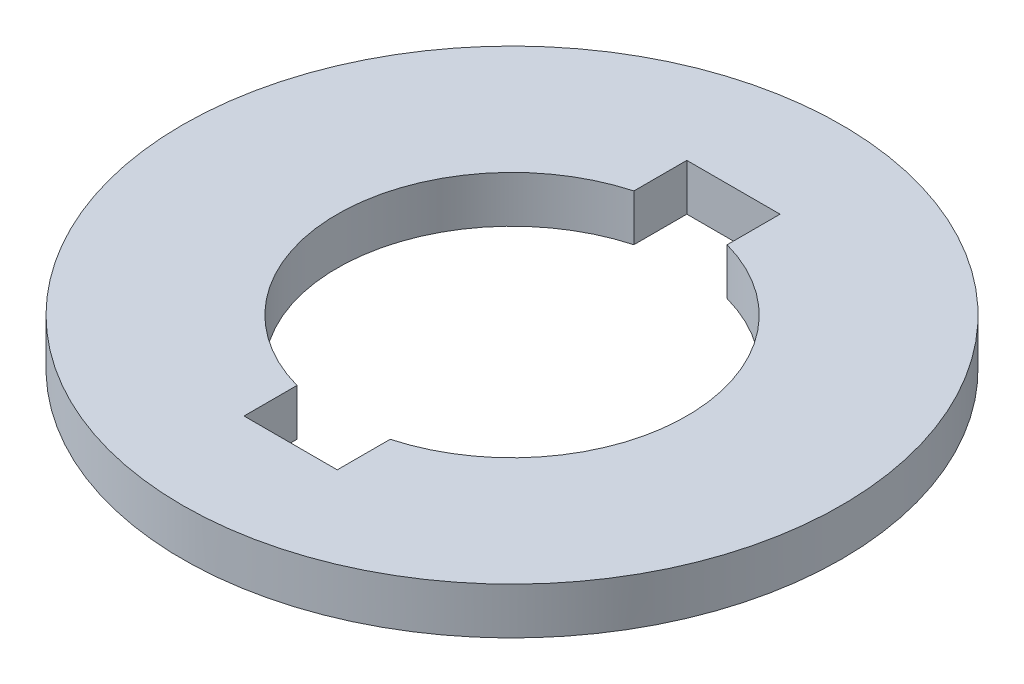
ISO-10303-21;
HEADER;
FILE_DESCRIPTION(('STEP AP214'),'2;1');
FILE_NAME('part.step','',(''),(''),'','','');
FILE_SCHEMA(('AUTOMOTIVE_DESIGN { 1 0 10303 214 1 1 1 1 }'));
ENDSEC;
DATA;
#1=APPLICATION_CONTEXT('core data for automotive mechanical design processes');
#2=APPLICATION_PROTOCOL_DEFINITION('international standard','automotive_design',2000,#1);
#3=PRODUCT_CONTEXT('',#1,'mechanical');
#4=PRODUCT('Part','Part','',(#3));
#5=PRODUCT_RELATED_PRODUCT_CATEGORY('part','',(#4));
#6=PRODUCT_DEFINITION_FORMATION('','',#4);
#7=PRODUCT_DEFINITION_CONTEXT('part definition',#1,'design');
#8=PRODUCT_DEFINITION('design','',#6,#7);
#9=PRODUCT_DEFINITION_SHAPE('','',#8);
#10=(LENGTH_UNIT() NAMED_UNIT(*) SI_UNIT(.MILLI.,.METRE.));
#11=(NAMED_UNIT(*) PLANE_ANGLE_UNIT() SI_UNIT($,.RADIAN.));
#12=(NAMED_UNIT(*) SI_UNIT($,.STERADIAN.) SOLID_ANGLE_UNIT());
#13=UNCERTAINTY_MEASURE_WITH_UNIT(LENGTH_MEASURE(1.E-05),#10,'distance_accuracy_value','');
#14=(GEOMETRIC_REPRESENTATION_CONTEXT(3) GLOBAL_UNCERTAINTY_ASSIGNED_CONTEXT((#13)) GLOBAL_UNIT_ASSIGNED_CONTEXT((#10,
#11,#12)) REPRESENTATION_CONTEXT('',''));
#15=CARTESIAN_POINT('',(0.,0.,0.));
#16=DIRECTION('',(0.,0.,1.));
#17=DIRECTION('',(1.,0.,0.));
#18=AXIS2_PLACEMENT_3D('',#15,#16,#17);
#19=CARTESIAN_POINT('',(0.,-3.81,12.7));
#20=DIRECTION('',(0.,1.,0.));
#21=DIRECTION('',(-1.,0.,0.));
#22=AXIS2_PLACEMENT_3D('',#19,#20,#21);
#23=CYLINDRICAL_SURFACE('',#22,9.525);
#24=DIRECTION('',(0.,1.,0.));
#25=VECTOR('',#24,1.);
#26=CARTESIAN_POINT('',(2.54,-3.81,3.51991149280139));
#27=LINE('',#26,#25);
#28=CARTESIAN_POINT('',(2.54,-3.81,3.51991149280139));
#29=VERTEX_POINT('',#28);
#30=CARTESIAN_POINT('',(2.54,-1.27,3.51991149280139));
#31=VERTEX_POINT('',#30);
#32=EDGE_CURVE('E172',#29,#31,#27,.T.);
#33=ORIENTED_EDGE('',*,*,#32,.F.);
#34=CARTESIAN_POINT('',(0.,-3.81,12.7));
#35=DIRECTION('',(0.,1.,0.));
#36=DIRECTION('',(0.,0.,1.));
#37=AXIS2_PLACEMENT_3D('',#34,#35,#36);
#38=CIRCLE('',#37,9.525);
#39=CARTESIAN_POINT('',(2.54,-3.81,21.8800885071986));
#40=VERTEX_POINT('',#39);
#41=EDGE_CURVE('E53',#40,#29,#38,.T.);
#42=ORIENTED_EDGE('',*,*,#41,.F.);
#43=DIRECTION('',(0.,1.,0.));
#44=VECTOR('',#43,1.);
#45=CARTESIAN_POINT('',(2.54,-3.81,21.8800885071986));
#46=LINE('',#45,#44);
#47=CARTESIAN_POINT('',(2.54,-1.27,21.8800885071986));
#48=VERTEX_POINT('',#47);
#49=EDGE_CURVE('E171',#40,#48,#46,.T.);
#50=ORIENTED_EDGE('',*,*,#49,.T.);
#51=CARTESIAN_POINT('',(0.,-1.27,12.7));
#52=DIRECTION('',(0.,1.,0.));
#53=DIRECTION('',(0.,0.,1.));
#54=AXIS2_PLACEMENT_3D('',#51,#52,#53);
#55=CIRCLE('',#54,9.525);
#56=EDGE_CURVE('E139',#48,#31,#55,.T.);
#57=ORIENTED_EDGE('',*,*,#56,.T.);
#58=EDGE_LOOP('',(#33,#42,#50,#57));
#59=FACE_BOUND('',#58,.T.);
#60=ADVANCED_FACE('F43',(#59),#23,.F.);
#61=CARTESIAN_POINT('',(0.,-3.81,12.7));
#62=DIRECTION('',(0.,1.,0.));
#63=DIRECTION('',(0.,0.,1.));
#64=AXIS2_PLACEMENT_3D('',#61,#62,#63);
#65=CIRCLE('',#64,9.525);
#66=CARTESIAN_POINT('',(-2.54,-3.81,3.51991149280139));
#67=VERTEX_POINT('',#66);
#68=CARTESIAN_POINT('',(-2.54,-3.81,21.8800885071986));
#69=VERTEX_POINT('',#68);
#70=EDGE_CURVE('E129',#67,#69,#65,.T.);
#71=ORIENTED_EDGE('',*,*,#70,.F.);
#72=DIRECTION('',(0.,1.,0.));
#73=VECTOR('',#72,1.);
#74=CARTESIAN_POINT('',(-2.54,-3.81,3.51991149280139));
#75=LINE('',#74,#73);
#76=CARTESIAN_POINT('',(-2.54,-1.27,3.51991149280139));
#77=VERTEX_POINT('',#76);
#78=EDGE_CURVE('E114',#67,#77,#75,.T.);
#79=ORIENTED_EDGE('',*,*,#78,.T.);
#80=CARTESIAN_POINT('',(0.,-1.27,12.7));
#81=DIRECTION('',(0.,1.,0.));
#82=DIRECTION('',(0.,0.,1.));
#83=AXIS2_PLACEMENT_3D('',#80,#81,#82);
#84=CIRCLE('',#83,9.525);
#85=CARTESIAN_POINT('',(-2.54,-1.27,21.8800885071986));
#86=VERTEX_POINT('',#85);
#87=EDGE_CURVE('E152',#77,#86,#84,.T.);
#88=ORIENTED_EDGE('',*,*,#87,.T.);
#89=DIRECTION('',(0.,1.,0.));
#90=VECTOR('',#89,1.);
#91=CARTESIAN_POINT('',(-2.54,-3.81,21.8800885071986));
#92=LINE('',#91,#90);
#93=EDGE_CURVE('E62',#69,#86,#92,.T.);
#94=ORIENTED_EDGE('',*,*,#93,.F.);
#95=EDGE_LOOP('',(#71,#79,#88,#94));
#96=FACE_BOUND('',#95,.T.);
#97=ADVANCED_FACE('F133',(#96),#23,.F.);
#98=CARTESIAN_POINT('',(0.,-3.81,12.7));
#99=DIRECTION('',(0.,1.,0.));
#100=DIRECTION('',(-1.,0.,0.));
#101=AXIS2_PLACEMENT_3D('',#98,#99,#100);
#102=CYLINDRICAL_SURFACE('',#101,17.9578);
#103=CARTESIAN_POINT('',(0.,-3.81,12.7));
#104=DIRECTION('',(0.,1.,0.));
#105=DIRECTION('',(-1.,0.,0.));
#106=AXIS2_PLACEMENT_3D('',#103,#104,#105);
#107=CIRCLE('',#106,17.9578);
#108=CARTESIAN_POINT('',(-17.9578,-3.81,12.7));
#109=VERTEX_POINT('',#108);
#110=EDGE_CURVE('E11',#109,#109,#107,.T.);
#111=ORIENTED_EDGE('',*,*,#110,.T.);
#112=EDGE_LOOP('',(#111));
#113=FACE_BOUND('',#112,.T.);
#114=CARTESIAN_POINT('',(0.,-1.27,12.7));
#115=DIRECTION('',(0.,1.,0.));
#116=DIRECTION('',(0.,0.,1.));
#117=AXIS2_PLACEMENT_3D('',#114,#115,#116);
#118=CIRCLE('',#117,17.9578);
#119=CARTESIAN_POINT('',(0.,-1.27,30.6578));
#120=VERTEX_POINT('',#119);
#121=EDGE_CURVE('E134',#120,#120,#118,.T.);
#122=ORIENTED_EDGE('',*,*,#121,.F.);
#123=EDGE_LOOP('',(#122));
#124=FACE_BOUND('',#123,.T.);
#125=ADVANCED_FACE('F210',(#113,#124),#102,.T.);
#126=CARTESIAN_POINT('',(0.,-3.81,0.));
#127=DIRECTION('',(0.,1.,0.));
#128=DIRECTION('',(0.,0.,1.));
#129=AXIS2_PLACEMENT_3D('',#126,#127,#128);
#130=PLANE('',#129);
#131=DIRECTION('',(1.,0.,0.));
#132=VECTOR('',#131,1.);
#133=CARTESIAN_POINT('',(0.,-3.81,0.634999999999997));
#134=LINE('',#133,#132);
#135=CARTESIAN_POINT('',(-2.54,-3.81,0.634999999999997));
#136=VERTEX_POINT('',#135);
#137=CARTESIAN_POINT('',(2.54,-3.81,0.634999999999997));
#138=VERTEX_POINT('',#137);
#139=EDGE_CURVE('E104',#136,#138,#134,.T.);
#140=ORIENTED_EDGE('',*,*,#139,.F.);
#141=DIRECTION('',(0.,0.,1.));
#142=VECTOR('',#141,1.);
#143=CARTESIAN_POINT('',(-2.54,-3.81,0.));
#144=LINE('',#143,#142);
#145=EDGE_CURVE('E117',#136,#67,#144,.T.);
#146=ORIENTED_EDGE('',*,*,#145,.T.);
#147=ORIENTED_EDGE('',*,*,#70,.T.);
#148=DIRECTION('',(0.,0.,-1.));
#149=VECTOR('',#148,1.);
#150=CARTESIAN_POINT('',(-2.54,-3.81,0.));
#151=LINE('',#150,#149);
#152=CARTESIAN_POINT('',(-2.54,-3.81,24.765));
#153=VERTEX_POINT('',#152);
#154=EDGE_CURVE('E110',#153,#69,#151,.T.);
#155=ORIENTED_EDGE('',*,*,#154,.F.);
#156=DIRECTION('',(1.,0.,0.));
#157=VECTOR('',#156,1.);
#158=CARTESIAN_POINT('',(0.,-3.81,24.765));
#159=LINE('',#158,#157);
#160=CARTESIAN_POINT('',(2.54,-3.81,24.765));
#161=VERTEX_POINT('',#160);
#162=EDGE_CURVE('E144',#153,#161,#159,.T.);
#163=ORIENTED_EDGE('',*,*,#162,.T.);
#164=DIRECTION('',(0.,0.,-1.));
#165=VECTOR('',#164,1.);
#166=CARTESIAN_POINT('',(2.54,-3.81,0.));
#167=LINE('',#166,#165);
#168=EDGE_CURVE('E147',#161,#40,#167,.T.);
#169=ORIENTED_EDGE('',*,*,#168,.T.);
#170=ORIENTED_EDGE('',*,*,#41,.T.);
#171=DIRECTION('',(0.,0.,1.));
#172=VECTOR('',#171,1.);
#173=CARTESIAN_POINT('',(2.54,-3.81,0.));
#174=LINE('',#173,#172);
#175=EDGE_CURVE('E150',#138,#29,#174,.T.);
#176=ORIENTED_EDGE('',*,*,#175,.F.);
#177=EDGE_LOOP('',(#140,#146,#147,#155,#163,#169,#170,#176));
#178=FACE_BOUND('',#177,.T.);
#179=ORIENTED_EDGE('',*,*,#110,.F.);
#180=EDGE_LOOP('',(#179));
#181=FACE_BOUND('',#180,.T.);
#182=ADVANCED_FACE('F127',(#178,#181),#130,.F.);
#183=CARTESIAN_POINT('',(0.,-1.27,0.));
#184=DIRECTION('',(0.,1.,0.));
#185=DIRECTION('',(0.,0.,1.));
#186=AXIS2_PLACEMENT_3D('',#183,#184,#185);
#187=PLANE('',#186);
#188=DIRECTION('',(0.,0.,1.));
#189=VECTOR('',#188,1.);
#190=CARTESIAN_POINT('',(-2.54,-1.27,0.));
#191=LINE('',#190,#189);
#192=CARTESIAN_POINT('',(-2.54,-1.27,0.634999999999997));
#193=VERTEX_POINT('',#192);
#194=EDGE_CURVE('E119',#193,#77,#191,.T.);
#195=ORIENTED_EDGE('',*,*,#194,.F.);
#196=DIRECTION('',(1.,0.,0.));
#197=VECTOR('',#196,1.);
#198=CARTESIAN_POINT('',(0.,-1.27,0.634999999999997));
#199=LINE('',#198,#197);
#200=CARTESIAN_POINT('',(2.54,-1.27,0.634999999999997));
#201=VERTEX_POINT('',#200);
#202=EDGE_CURVE('E131',#193,#201,#199,.T.);
#203=ORIENTED_EDGE('',*,*,#202,.T.);
#204=DIRECTION('',(0.,0.,1.));
#205=VECTOR('',#204,1.);
#206=CARTESIAN_POINT('',(2.54,-1.27,0.));
#207=LINE('',#206,#205);
#208=EDGE_CURVE('E160',#201,#31,#207,.T.);
#209=ORIENTED_EDGE('',*,*,#208,.T.);
#210=ORIENTED_EDGE('',*,*,#56,.F.);
#211=DIRECTION('',(0.,0.,-1.));
#212=VECTOR('',#211,1.);
#213=CARTESIAN_POINT('',(2.54,-1.27,0.));
#214=LINE('',#213,#212);
#215=CARTESIAN_POINT('',(2.54,-1.27,24.765));
#216=VERTEX_POINT('',#215);
#217=EDGE_CURVE('E163',#216,#48,#214,.T.);
#218=ORIENTED_EDGE('',*,*,#217,.F.);
#219=DIRECTION('',(1.,0.,0.));
#220=VECTOR('',#219,1.);
#221=CARTESIAN_POINT('',(0.,-1.27,24.765));
#222=LINE('',#221,#220);
#223=CARTESIAN_POINT('',(-2.54,-1.27,24.765));
#224=VERTEX_POINT('',#223);
#225=EDGE_CURVE('E165',#224,#216,#222,.T.);
#226=ORIENTED_EDGE('',*,*,#225,.F.);
#227=DIRECTION('',(0.,0.,-1.));
#228=VECTOR('',#227,1.);
#229=CARTESIAN_POINT('',(-2.54,-1.27,0.));
#230=LINE('',#229,#228);
#231=EDGE_CURVE('E157',#224,#86,#230,.T.);
#232=ORIENTED_EDGE('',*,*,#231,.T.);
#233=ORIENTED_EDGE('',*,*,#87,.F.);
#234=EDGE_LOOP('',(#195,#203,#209,#210,#218,#226,#232,#233));
#235=FACE_BOUND('',#234,.T.);
#236=ORIENTED_EDGE('',*,*,#121,.T.);
#237=EDGE_LOOP('',(#236));
#238=FACE_BOUND('',#237,.T.);
#239=ADVANCED_FACE('F187',(#235,#238),#187,.T.);
#240=CARTESIAN_POINT('',(-2.54,-3.81,0.));
#241=DIRECTION('',(1.,0.,0.));
#242=DIRECTION('',(0.,0.,-1.));
#243=AXIS2_PLACEMENT_3D('',#240,#241,#242);
#244=PLANE('',#243);
#245=ORIENTED_EDGE('',*,*,#231,.F.);
#246=DIRECTION('',(0.,1.,0.));
#247=VECTOR('',#246,1.);
#248=CARTESIAN_POINT('',(-2.54,-3.81,24.765));
#249=LINE('',#248,#247);
#250=EDGE_CURVE('E155',#153,#224,#249,.T.);
#251=ORIENTED_EDGE('',*,*,#250,.F.);
#252=ORIENTED_EDGE('',*,*,#154,.T.);
#253=ORIENTED_EDGE('',*,*,#93,.T.);
#254=EDGE_LOOP('',(#245,#251,#252,#253));
#255=FACE_BOUND('',#254,.T.);
#256=ADVANCED_FACE('F196',(#255),#244,.T.);
#257=CARTESIAN_POINT('',(0.,-3.81,24.765));
#258=DIRECTION('',(0.,0.,1.));
#259=DIRECTION('',(1.,0.,0.));
#260=AXIS2_PLACEMENT_3D('',#257,#258,#259);
#261=PLANE('',#260);
#262=ORIENTED_EDGE('',*,*,#225,.T.);
#263=DIRECTION('',(0.,1.,0.));
#264=VECTOR('',#263,1.);
#265=CARTESIAN_POINT('',(2.54,-3.81,24.765));
#266=LINE('',#265,#264);
#267=EDGE_CURVE('E170',#161,#216,#266,.T.);
#268=ORIENTED_EDGE('',*,*,#267,.F.);
#269=ORIENTED_EDGE('',*,*,#162,.F.);
#270=ORIENTED_EDGE('',*,*,#250,.T.);
#271=EDGE_LOOP('',(#262,#268,#269,#270));
#272=FACE_BOUND('',#271,.T.);
#273=ADVANCED_FACE('F195',(#272),#261,.F.);
#274=CARTESIAN_POINT('',(2.54,-3.81,0.));
#275=DIRECTION('',(1.,0.,0.));
#276=DIRECTION('',(0.,0.,-1.));
#277=AXIS2_PLACEMENT_3D('',#274,#275,#276);
#278=PLANE('',#277);
#279=ORIENTED_EDGE('',*,*,#217,.T.);
#280=ORIENTED_EDGE('',*,*,#49,.F.);
#281=ORIENTED_EDGE('',*,*,#168,.F.);
#282=ORIENTED_EDGE('',*,*,#267,.T.);
#283=EDGE_LOOP('',(#279,#280,#281,#282));
#284=FACE_BOUND('',#283,.T.);
#285=ADVANCED_FACE('F192',(#284),#278,.F.);
#286=CARTESIAN_POINT('',(-2.54,-3.81,0.));
#287=DIRECTION('',(-1.,0.,0.));
#288=DIRECTION('',(0.,0.,1.));
#289=AXIS2_PLACEMENT_3D('',#286,#287,#288);
#290=PLANE('',#289);
#291=ORIENTED_EDGE('',*,*,#194,.T.);
#292=ORIENTED_EDGE('',*,*,#78,.F.);
#293=ORIENTED_EDGE('',*,*,#145,.F.);
#294=DIRECTION('',(0.,1.,0.));
#295=VECTOR('',#294,1.);
#296=CARTESIAN_POINT('',(-2.54,-3.81,0.634999999999997));
#297=LINE('',#296,#295);
#298=EDGE_CURVE('E98',#136,#193,#297,.T.);
#299=ORIENTED_EDGE('',*,*,#298,.T.);
#300=EDGE_LOOP('',(#291,#292,#293,#299));
#301=FACE_BOUND('',#300,.T.);
#302=ADVANCED_FACE('F116',(#301),#290,.F.);
#303=CARTESIAN_POINT('',(0.,-3.81,0.634999999999997));
#304=DIRECTION('',(0.,0.,1.));
#305=DIRECTION('',(1.,0.,0.));
#306=AXIS2_PLACEMENT_3D('',#303,#304,#305);
#307=PLANE('',#306);
#308=ORIENTED_EDGE('',*,*,#202,.F.);
#309=ORIENTED_EDGE('',*,*,#298,.F.);
#310=ORIENTED_EDGE('',*,*,#139,.T.);
#311=DIRECTION('',(0.,1.,0.));
#312=VECTOR('',#311,1.);
#313=CARTESIAN_POINT('',(2.54,-3.81,0.634999999999997));
#314=LINE('',#313,#312);
#315=EDGE_CURVE('E47',#138,#201,#314,.T.);
#316=ORIENTED_EDGE('',*,*,#315,.T.);
#317=EDGE_LOOP('',(#308,#309,#310,#316));
#318=FACE_BOUND('',#317,.T.);
#319=ADVANCED_FACE('F272',(#318),#307,.T.);
#320=CARTESIAN_POINT('',(2.54,-3.81,0.));
#321=DIRECTION('',(-1.,0.,0.));
#322=DIRECTION('',(0.,0.,1.));
#323=AXIS2_PLACEMENT_3D('',#320,#321,#322);
#324=PLANE('',#323);
#325=ORIENTED_EDGE('',*,*,#208,.F.);
#326=ORIENTED_EDGE('',*,*,#315,.F.);
#327=ORIENTED_EDGE('',*,*,#175,.T.);
#328=ORIENTED_EDGE('',*,*,#32,.T.);
#329=EDGE_LOOP('',(#325,#326,#327,#328));
#330=FACE_BOUND('',#329,.T.);
#331=ADVANCED_FACE('F45',(#330),#324,.T.);
#332=CLOSED_SHELL('',(#60,#97,#125,#182,#239,#256,#273,#285,#302,#319,#331));
#333=MANIFOLD_SOLID_BREP('B2',#332);
#334=ADVANCED_BREP_SHAPE_REPRESENTATION('',(#18,#333),#14);
#335=SHAPE_DEFINITION_REPRESENTATION(#9,#334);
ENDSEC;
END-ISO-10303-21;
